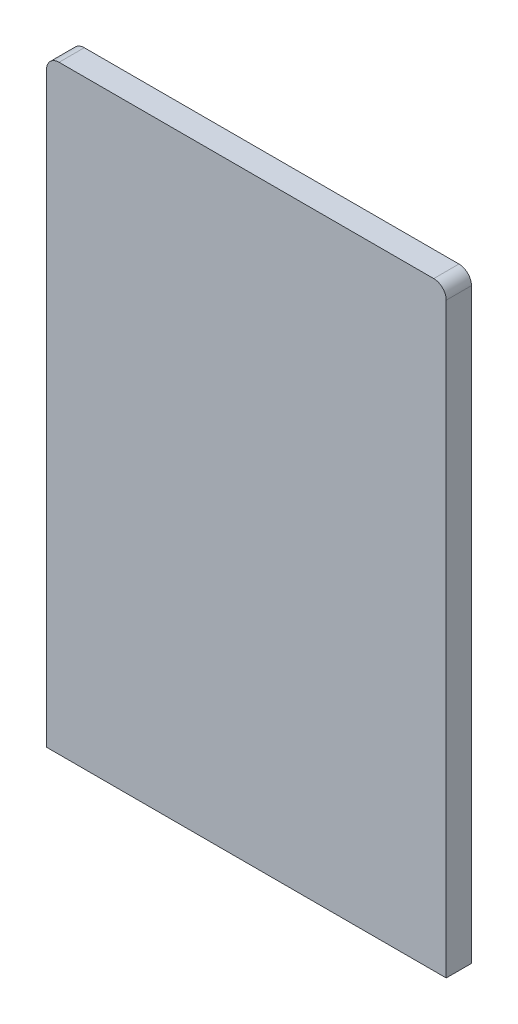
ISO-10303-21;
HEADER;
FILE_DESCRIPTION(('STEP AP214'),'2;1');
FILE_NAME('part.step','',(''),(''),'','','');
FILE_SCHEMA(('AUTOMOTIVE_DESIGN { 1 0 10303 214 1 1 1 1 }'));
ENDSEC;
DATA;
#1=APPLICATION_CONTEXT('core data for automotive mechanical design processes');
#2=APPLICATION_PROTOCOL_DEFINITION('international standard','automotive_design',2000,#1);
#3=PRODUCT_CONTEXT('',#1,'mechanical');
#4=PRODUCT('Part','Part','',(#3));
#5=PRODUCT_RELATED_PRODUCT_CATEGORY('part','',(#4));
#6=PRODUCT_DEFINITION_FORMATION('','',#4);
#7=PRODUCT_DEFINITION_CONTEXT('part definition',#1,'design');
#8=PRODUCT_DEFINITION('design','',#6,#7);
#9=PRODUCT_DEFINITION_SHAPE('','',#8);
#10=(LENGTH_UNIT() NAMED_UNIT(*) SI_UNIT(.MILLI.,.METRE.));
#11=(NAMED_UNIT(*) PLANE_ANGLE_UNIT() SI_UNIT($,.RADIAN.));
#12=(NAMED_UNIT(*) SI_UNIT($,.STERADIAN.) SOLID_ANGLE_UNIT());
#13=UNCERTAINTY_MEASURE_WITH_UNIT(LENGTH_MEASURE(1.E-05),#10,'distance_accuracy_value','');
#14=(GEOMETRIC_REPRESENTATION_CONTEXT(3) GLOBAL_UNCERTAINTY_ASSIGNED_CONTEXT((#13)) GLOBAL_UNIT_ASSIGNED_CONTEXT((#10,
#11,#12)) REPRESENTATION_CONTEXT('',''));
#15=CARTESIAN_POINT('',(0.,0.,0.));
#16=DIRECTION('',(0.,0.,1.));
#17=DIRECTION('',(1.,0.,0.));
#18=AXIS2_PLACEMENT_3D('',#15,#16,#17);
#19=CARTESIAN_POINT('',(4.,0.,0.105));
#20=DIRECTION('',(1.,0.,0.));
#21=DIRECTION('',(0.,1.,0.));
#22=AXIS2_PLACEMENT_3D('',#19,#20,#21);
#23=PLANE('',#22);
#24=DIRECTION('',(0.,0.,-1.));
#25=VECTOR('',#24,1.);
#26=CARTESIAN_POINT('',(4.,-8.,0.105));
#27=LINE('',#26,#25);
#28=CARTESIAN_POINT('',(4.,-8.,0.305));
#29=VERTEX_POINT('',#28);
#30=CARTESIAN_POINT('',(4.,-8.,-0.2));
#31=VERTEX_POINT('',#30);
#32=EDGE_CURVE('E189',#29,#31,#27,.T.);
#33=ORIENTED_EDGE('',*,*,#32,.T.);
#34=DIRECTION('',(0.,-1.,0.));
#35=VECTOR('',#34,1.);
#36=CARTESIAN_POINT('',(4.,0.,-0.2));
#37=LINE('',#36,#35);
#38=CARTESIAN_POINT('',(4.,3.75,-0.2));
#39=VERTEX_POINT('',#38);
#40=EDGE_CURVE('E176',#39,#31,#37,.T.);
#41=ORIENTED_EDGE('',*,*,#40,.F.);
#42=DIRECTION('',(0.,0.,-1.));
#43=VECTOR('',#42,1.);
#44=CARTESIAN_POINT('',(4.,3.75,0.105));
#45=LINE('',#44,#43);
#46=CARTESIAN_POINT('',(4.,3.75,0.305));
#47=VERTEX_POINT('',#46);
#48=EDGE_CURVE('E205',#39,#47,#45,.F.);
#49=ORIENTED_EDGE('',*,*,#48,.T.);
#50=DIRECTION('',(0.,1.,0.));
#51=VECTOR('',#50,1.);
#52=CARTESIAN_POINT('',(4.,0.,0.305));
#53=LINE('',#52,#51);
#54=EDGE_CURVE('E150',#29,#47,#53,.T.);
#55=ORIENTED_EDGE('',*,*,#54,.F.);
#56=EDGE_LOOP('',(#33,#41,#49,#55));
#57=FACE_BOUND('',#56,.T.);
#58=ADVANCED_FACE('F35',(#57),#23,.T.);
#59=CARTESIAN_POINT('',(0.,4.,0.105));
#60=DIRECTION('',(0.,1.,0.));
#61=DIRECTION('',(0.,0.,1.));
#62=AXIS2_PLACEMENT_3D('',#59,#60,#61);
#63=PLANE('',#62);
#64=DIRECTION('',(0.,0.,-1.));
#65=VECTOR('',#64,1.);
#66=CARTESIAN_POINT('',(3.75,4.,0.105));
#67=LINE('',#66,#65);
#68=CARTESIAN_POINT('',(3.75,4.,0.305));
#69=VERTEX_POINT('',#68);
#70=CARTESIAN_POINT('',(3.75,4.,-0.2));
#71=VERTEX_POINT('',#70);
#72=EDGE_CURVE('E125',#69,#71,#67,.T.);
#73=ORIENTED_EDGE('',*,*,#72,.T.);
#74=DIRECTION('',(1.,0.,0.));
#75=VECTOR('',#74,1.);
#76=CARTESIAN_POINT('',(0.,4.,-0.2));
#77=LINE('',#76,#75);
#78=CARTESIAN_POINT('',(-3.75,4.,-0.2));
#79=VERTEX_POINT('',#78);
#80=EDGE_CURVE('E173',#79,#71,#77,.T.);
#81=ORIENTED_EDGE('',*,*,#80,.F.);
#82=DIRECTION('',(0.,0.,-1.));
#83=VECTOR('',#82,1.);
#84=CARTESIAN_POINT('',(-3.75,4.,0.105));
#85=LINE('',#84,#83);
#86=CARTESIAN_POINT('',(-3.75,4.,0.305));
#87=VERTEX_POINT('',#86);
#88=EDGE_CURVE('E135',#79,#87,#85,.F.);
#89=ORIENTED_EDGE('',*,*,#88,.T.);
#90=DIRECTION('',(-1.,0.,0.));
#91=VECTOR('',#90,1.);
#92=CARTESIAN_POINT('',(0.,4.,0.305));
#93=LINE('',#92,#91);
#94=EDGE_CURVE('E139',#69,#87,#93,.T.);
#95=ORIENTED_EDGE('',*,*,#94,.F.);
#96=EDGE_LOOP('',(#73,#81,#89,#95));
#97=FACE_BOUND('',#96,.T.);
#98=ADVANCED_FACE('F140',(#97),#63,.T.);
#99=CARTESIAN_POINT('',(-4.,0.,0.105));
#100=DIRECTION('',(-1.,0.,0.));
#101=DIRECTION('',(0.,0.,1.));
#102=AXIS2_PLACEMENT_3D('',#99,#100,#101);
#103=PLANE('',#102);
#104=DIRECTION('',(0.,0.,-1.));
#105=VECTOR('',#104,1.);
#106=CARTESIAN_POINT('',(-4.,-8.,0.105));
#107=LINE('',#106,#105);
#108=CARTESIAN_POINT('',(-4.,-8.,0.305));
#109=VERTEX_POINT('',#108);
#110=CARTESIAN_POINT('',(-4.,-8.,-0.2));
#111=VERTEX_POINT('',#110);
#112=EDGE_CURVE('E201',#109,#111,#107,.T.);
#113=ORIENTED_EDGE('',*,*,#112,.F.);
#114=DIRECTION('',(0.,-1.,0.));
#115=VECTOR('',#114,1.);
#116=CARTESIAN_POINT('',(-4.,0.,0.305));
#117=LINE('',#116,#115);
#118=CARTESIAN_POINT('',(-4.,3.75,0.305));
#119=VERTEX_POINT('',#118);
#120=EDGE_CURVE('E157',#119,#109,#117,.T.);
#121=ORIENTED_EDGE('',*,*,#120,.F.);
#122=DIRECTION('',(0.,0.,-1.));
#123=VECTOR('',#122,1.);
#124=CARTESIAN_POINT('',(-4.,3.75,0.105));
#125=LINE('',#124,#123);
#126=CARTESIAN_POINT('',(-4.,3.75,-0.2));
#127=VERTEX_POINT('',#126);
#128=EDGE_CURVE('E136',#119,#127,#125,.T.);
#129=ORIENTED_EDGE('',*,*,#128,.T.);
#130=DIRECTION('',(0.,1.,0.));
#131=VECTOR('',#130,1.);
#132=CARTESIAN_POINT('',(-4.,0.,-0.2));
#133=LINE('',#132,#131);
#134=EDGE_CURVE('E167',#111,#127,#133,.T.);
#135=ORIENTED_EDGE('',*,*,#134,.F.);
#136=EDGE_LOOP('',(#113,#121,#129,#135));
#137=FACE_BOUND('',#136,.T.);
#138=ADVANCED_FACE('F251',(#137),#103,.T.);
#139=CARTESIAN_POINT('',(-2.75,0.,0.105));
#140=DIRECTION('',(1.,0.,0.));
#141=DIRECTION('',(0.,1.,0.));
#142=AXIS2_PLACEMENT_3D('',#139,#140,#141);
#143=PLANE('',#142);
#144=DIRECTION('',(0.,-1.,0.));
#145=VECTOR('',#144,1.);
#146=CARTESIAN_POINT('',(-2.75,0.,0.));
#147=LINE('',#146,#145);
#148=CARTESIAN_POINT('',(-2.75,2.5,0.));
#149=VERTEX_POINT('',#148);
#150=CARTESIAN_POINT('',(-2.75,-8.,0.));
#151=VERTEX_POINT('',#150);
#152=EDGE_CURVE('E179',#149,#151,#147,.T.);
#153=ORIENTED_EDGE('',*,*,#152,.F.);
#154=DIRECTION('',(0.,0.,-1.));
#155=VECTOR('',#154,1.);
#156=CARTESIAN_POINT('',(-2.75,2.5,0.105));
#157=LINE('',#156,#155);
#158=CARTESIAN_POINT('',(-2.75,2.5,0.105));
#159=VERTEX_POINT('',#158);
#160=EDGE_CURVE('E211',#149,#159,#157,.F.);
#161=ORIENTED_EDGE('',*,*,#160,.T.);
#162=DIRECTION('',(0.,-1.,0.));
#163=VECTOR('',#162,1.);
#164=CARTESIAN_POINT('',(-2.75,0.,0.105));
#165=LINE('',#164,#163);
#166=CARTESIAN_POINT('',(-2.75,-8.,0.105));
#167=VERTEX_POINT('',#166);
#168=EDGE_CURVE('E182',#159,#167,#165,.T.);
#169=ORIENTED_EDGE('',*,*,#168,.T.);
#170=DIRECTION('',(0.,0.,-1.));
#171=VECTOR('',#170,1.);
#172=CARTESIAN_POINT('',(-2.75,-8.,0.105));
#173=LINE('',#172,#171);
#174=EDGE_CURVE('E199',#167,#151,#173,.T.);
#175=ORIENTED_EDGE('',*,*,#174,.T.);
#176=EDGE_LOOP('',(#153,#161,#169,#175));
#177=FACE_BOUND('',#176,.T.);
#178=ADVANCED_FACE('F235',(#177),#143,.T.);
#179=CARTESIAN_POINT('',(0.,2.75,0.105));
#180=DIRECTION('',(0.,1.,0.));
#181=DIRECTION('',(0.,0.,1.));
#182=AXIS2_PLACEMENT_3D('',#179,#180,#181);
#183=PLANE('',#182);
#184=DIRECTION('',(1.,0.,0.));
#185=VECTOR('',#184,1.);
#186=CARTESIAN_POINT('',(0.,2.75,0.105));
#187=LINE('',#186,#185);
#188=CARTESIAN_POINT('',(-2.5,2.75,0.105));
#189=VERTEX_POINT('',#188);
#190=CARTESIAN_POINT('',(2.5,2.75,0.105));
#191=VERTEX_POINT('',#190);
#192=EDGE_CURVE('E184',#189,#191,#187,.T.);
#193=ORIENTED_EDGE('',*,*,#192,.F.);
#194=DIRECTION('',(0.,0.,-1.));
#195=VECTOR('',#194,1.);
#196=CARTESIAN_POINT('',(-2.5,2.75,0.105));
#197=LINE('',#196,#195);
#198=CARTESIAN_POINT('',(-2.5,2.75,0.));
#199=VERTEX_POINT('',#198);
#200=EDGE_CURVE('E208',#189,#199,#197,.T.);
#201=ORIENTED_EDGE('',*,*,#200,.T.);
#202=DIRECTION('',(1.,0.,0.));
#203=VECTOR('',#202,1.);
#204=CARTESIAN_POINT('',(0.,2.75,0.));
#205=LINE('',#204,#203);
#206=CARTESIAN_POINT('',(2.5,2.75,0.));
#207=VERTEX_POINT('',#206);
#208=EDGE_CURVE('E192',#199,#207,#205,.T.);
#209=ORIENTED_EDGE('',*,*,#208,.T.);
#210=DIRECTION('',(0.,0.,-1.));
#211=VECTOR('',#210,1.);
#212=CARTESIAN_POINT('',(2.5,2.75,0.105));
#213=LINE('',#212,#211);
#214=EDGE_CURVE('E58',#207,#191,#213,.F.);
#215=ORIENTED_EDGE('',*,*,#214,.T.);
#216=EDGE_LOOP('',(#193,#201,#209,#215));
#217=FACE_BOUND('',#216,.T.);
#218=ADVANCED_FACE('F243',(#217),#183,.F.);
#219=CARTESIAN_POINT('',(2.75,0.,0.105));
#220=DIRECTION('',(1.,0.,0.));
#221=DIRECTION('',(0.,1.,0.));
#222=AXIS2_PLACEMENT_3D('',#219,#220,#221);
#223=PLANE('',#222);
#224=DIRECTION('',(0.,-1.,0.));
#225=VECTOR('',#224,1.);
#226=CARTESIAN_POINT('',(2.75,0.,0.105));
#227=LINE('',#226,#225);
#228=CARTESIAN_POINT('',(2.75,2.5,0.105));
#229=VERTEX_POINT('',#228);
#230=CARTESIAN_POINT('',(2.75,-8.,0.105));
#231=VERTEX_POINT('',#230);
#232=EDGE_CURVE('E50',#229,#231,#227,.T.);
#233=ORIENTED_EDGE('',*,*,#232,.F.);
#234=DIRECTION('',(0.,0.,-1.));
#235=VECTOR('',#234,1.);
#236=CARTESIAN_POINT('',(2.75,2.5,0.));
#237=LINE('',#236,#235);
#238=CARTESIAN_POINT('',(2.75,2.5,0.));
#239=VERTEX_POINT('',#238);
#240=EDGE_CURVE('E213',#229,#239,#237,.T.);
#241=ORIENTED_EDGE('',*,*,#240,.T.);
#242=DIRECTION('',(0.,-1.,0.));
#243=VECTOR('',#242,1.);
#244=CARTESIAN_POINT('',(2.75,0.,0.));
#245=LINE('',#244,#243);
#246=CARTESIAN_POINT('',(2.75,-8.,0.));
#247=VERTEX_POINT('',#246);
#248=EDGE_CURVE('E185',#239,#247,#245,.T.);
#249=ORIENTED_EDGE('',*,*,#248,.T.);
#250=DIRECTION('',(0.,0.,-1.));
#251=VECTOR('',#250,1.);
#252=CARTESIAN_POINT('',(2.75,-8.,0.105));
#253=LINE('',#252,#251);
#254=EDGE_CURVE('E196',#231,#247,#253,.T.);
#255=ORIENTED_EDGE('',*,*,#254,.F.);
#256=EDGE_LOOP('',(#233,#241,#249,#255));
#257=FACE_BOUND('',#256,.T.);
#258=ADVANCED_FACE('F227',(#257),#223,.F.);
#259=CARTESIAN_POINT('',(0.,-8.,0.105));
#260=DIRECTION('',(0.,1.,0.));
#261=DIRECTION('',(0.,0.,1.));
#262=AXIS2_PLACEMENT_3D('',#259,#260,#261);
#263=PLANE('',#262);
#264=ORIENTED_EDGE('',*,*,#174,.F.);
#265=DIRECTION('',(1.,0.,0.));
#266=VECTOR('',#265,1.);
#267=CARTESIAN_POINT('',(0.,-8.,0.105));
#268=LINE('',#267,#266);
#269=EDGE_CURVE('E151',#167,#231,#268,.T.);
#270=ORIENTED_EDGE('',*,*,#269,.T.);
#271=ORIENTED_EDGE('',*,*,#254,.T.);
#272=DIRECTION('',(-1.,0.,0.));
#273=VECTOR('',#272,1.);
#274=CARTESIAN_POINT('',(0.,-8.,0.));
#275=LINE('',#274,#273);
#276=EDGE_CURVE('E162',#247,#151,#275,.T.);
#277=ORIENTED_EDGE('',*,*,#276,.T.);
#278=EDGE_LOOP('',(#264,#270,#271,#277));
#279=FACE_BOUND('',#278,.T.);
#280=DIRECTION('',(1.,0.,0.));
#281=VECTOR('',#280,1.);
#282=CARTESIAN_POINT('',(0.,-8.,0.305));
#283=LINE('',#282,#281);
#284=EDGE_CURVE('E160',#109,#29,#283,.T.);
#285=ORIENTED_EDGE('',*,*,#284,.F.);
#286=ORIENTED_EDGE('',*,*,#112,.T.);
#287=DIRECTION('',(-1.,0.,0.));
#288=VECTOR('',#287,1.);
#289=CARTESIAN_POINT('',(0.,-8.,-0.2));
#290=LINE('',#289,#288);
#291=EDGE_CURVE('E164',#31,#111,#290,.T.);
#292=ORIENTED_EDGE('',*,*,#291,.F.);
#293=ORIENTED_EDGE('',*,*,#32,.F.);
#294=EDGE_LOOP('',(#285,#286,#292,#293));
#295=FACE_BOUND('',#294,.T.);
#296=ADVANCED_FACE('F230',(#279,#295),#263,.F.);
#297=CARTESIAN_POINT('',(-3.75,3.75,0.105));
#298=DIRECTION('',(0.,0.,-1.));
#299=DIRECTION('',(-1.,0.,0.));
#300=AXIS2_PLACEMENT_3D('',#297,#298,#299);
#301=CYLINDRICAL_SURFACE('',#300,0.25);
#302=ORIENTED_EDGE('',*,*,#128,.F.);
#303=CARTESIAN_POINT('',(-3.75,3.75,0.305));
#304=DIRECTION('',(0.,0.,1.));
#305=DIRECTION('',(1.,0.,0.));
#306=AXIS2_PLACEMENT_3D('',#303,#304,#305);
#307=CIRCLE('',#306,0.25);
#308=EDGE_CURVE('E144',#87,#119,#307,.T.);
#309=ORIENTED_EDGE('',*,*,#308,.F.);
#310=ORIENTED_EDGE('',*,*,#88,.F.);
#311=CARTESIAN_POINT('',(-3.75,3.75,-0.2));
#312=DIRECTION('',(0.,0.,-1.));
#313=DIRECTION('',(-1.,0.,0.));
#314=AXIS2_PLACEMENT_3D('',#311,#312,#313);
#315=CIRCLE('',#314,0.25);
#316=EDGE_CURVE('E170',#127,#79,#315,.T.);
#317=ORIENTED_EDGE('',*,*,#316,.F.);
#318=EDGE_LOOP('',(#302,#309,#310,#317));
#319=FACE_BOUND('',#318,.T.);
#320=ADVANCED_FACE('F263',(#319),#301,.T.);
#321=CARTESIAN_POINT('',(3.75,3.75,0.105));
#322=DIRECTION('',(0.,0.,-1.));
#323=DIRECTION('',(-1.,0.,0.));
#324=AXIS2_PLACEMENT_3D('',#321,#322,#323);
#325=CYLINDRICAL_SURFACE('',#324,0.25);
#326=ORIENTED_EDGE('',*,*,#72,.F.);
#327=CARTESIAN_POINT('',(3.75,3.75,0.305));
#328=DIRECTION('',(0.,0.,1.));
#329=DIRECTION('',(1.,0.,0.));
#330=AXIS2_PLACEMENT_3D('',#327,#328,#329);
#331=CIRCLE('',#330,0.25);
#332=EDGE_CURVE('E129',#47,#69,#331,.T.);
#333=ORIENTED_EDGE('',*,*,#332,.F.);
#334=ORIENTED_EDGE('',*,*,#48,.F.);
#335=CARTESIAN_POINT('',(3.75,3.75,-0.2));
#336=DIRECTION('',(0.,0.,-1.));
#337=DIRECTION('',(-1.,0.,0.));
#338=AXIS2_PLACEMENT_3D('',#335,#336,#337);
#339=CIRCLE('',#338,0.25);
#340=EDGE_CURVE('E131',#71,#39,#339,.T.);
#341=ORIENTED_EDGE('',*,*,#340,.F.);
#342=EDGE_LOOP('',(#326,#333,#334,#341));
#343=FACE_BOUND('',#342,.T.);
#344=ADVANCED_FACE('F127',(#343),#325,.T.);
#345=CARTESIAN_POINT('',(-2.5,2.5,0.105));
#346=DIRECTION('',(0.,0.,-1.));
#347=DIRECTION('',(-1.,0.,0.));
#348=AXIS2_PLACEMENT_3D('',#345,#346,#347);
#349=CYLINDRICAL_SURFACE('',#348,0.25);
#350=CARTESIAN_POINT('',(-2.5,2.5,0.105));
#351=DIRECTION('',(0.,0.,1.));
#352=DIRECTION('',(1.,0.,0.));
#353=AXIS2_PLACEMENT_3D('',#350,#351,#352);
#354=CIRCLE('',#353,0.25);
#355=EDGE_CURVE('E218',#159,#189,#354,.F.);
#356=ORIENTED_EDGE('',*,*,#355,.F.);
#357=ORIENTED_EDGE('',*,*,#160,.F.);
#358=CARTESIAN_POINT('',(-2.5,2.5,0.));
#359=DIRECTION('',(0.,0.,1.));
#360=DIRECTION('',(1.,0.,0.));
#361=AXIS2_PLACEMENT_3D('',#358,#359,#360);
#362=CIRCLE('',#361,0.25);
#363=EDGE_CURVE('E215',#199,#149,#362,.T.);
#364=ORIENTED_EDGE('',*,*,#363,.F.);
#365=ORIENTED_EDGE('',*,*,#200,.F.);
#366=EDGE_LOOP('',(#356,#357,#364,#365));
#367=FACE_BOUND('',#366,.T.);
#368=ADVANCED_FACE('F238',(#367),#349,.F.);
#369=CARTESIAN_POINT('',(2.5,2.5,0.105));
#370=DIRECTION('',(0.,0.,1.));
#371=DIRECTION('',(1.,0.,0.));
#372=AXIS2_PLACEMENT_3D('',#369,#370,#371);
#373=CYLINDRICAL_SURFACE('',#372,0.25);
#374=CARTESIAN_POINT('',(2.5,2.5,0.105));
#375=DIRECTION('',(0.,0.,1.));
#376=DIRECTION('',(1.,0.,0.));
#377=AXIS2_PLACEMENT_3D('',#374,#375,#376);
#378=CIRCLE('',#377,0.25);
#379=EDGE_CURVE('E11',#191,#229,#378,.F.);
#380=ORIENTED_EDGE('',*,*,#379,.F.);
#381=ORIENTED_EDGE('',*,*,#214,.F.);
#382=CARTESIAN_POINT('',(2.5,2.5,0.));
#383=DIRECTION('',(0.,0.,1.));
#384=DIRECTION('',(1.,0.,0.));
#385=AXIS2_PLACEMENT_3D('',#382,#383,#384);
#386=CIRCLE('',#385,0.25);
#387=EDGE_CURVE('E43',#239,#207,#386,.T.);
#388=ORIENTED_EDGE('',*,*,#387,.F.);
#389=ORIENTED_EDGE('',*,*,#240,.F.);
#390=EDGE_LOOP('',(#380,#381,#388,#389));
#391=FACE_BOUND('',#390,.T.);
#392=ADVANCED_FACE('F37',(#391),#373,.F.);
#393=CARTESIAN_POINT('',(0.,0.,-0.2));
#394=DIRECTION('',(0.,0.,-1.));
#395=DIRECTION('',(-1.,0.,0.));
#396=AXIS2_PLACEMENT_3D('',#393,#394,#395);
#397=PLANE('',#396);
#398=ORIENTED_EDGE('',*,*,#291,.T.);
#399=ORIENTED_EDGE('',*,*,#134,.T.);
#400=ORIENTED_EDGE('',*,*,#316,.T.);
#401=ORIENTED_EDGE('',*,*,#80,.T.);
#402=ORIENTED_EDGE('',*,*,#340,.T.);
#403=ORIENTED_EDGE('',*,*,#40,.T.);
#404=EDGE_LOOP('',(#398,#399,#400,#401,#402,#403));
#405=FACE_BOUND('',#404,.T.);
#406=ADVANCED_FACE('F273',(#405),#397,.T.);
#407=CARTESIAN_POINT('',(0.,0.,0.));
#408=DIRECTION('',(0.,0.,-1.));
#409=DIRECTION('',(-1.,0.,0.));
#410=AXIS2_PLACEMENT_3D('',#407,#408,#409);
#411=PLANE('',#410);
#412=ORIENTED_EDGE('',*,*,#248,.F.);
#413=ORIENTED_EDGE('',*,*,#387,.T.);
#414=ORIENTED_EDGE('',*,*,#208,.F.);
#415=ORIENTED_EDGE('',*,*,#363,.T.);
#416=ORIENTED_EDGE('',*,*,#152,.T.);
#417=ORIENTED_EDGE('',*,*,#276,.F.);
#418=EDGE_LOOP('',(#412,#413,#414,#415,#416,#417));
#419=FACE_BOUND('',#418,.T.);
#420=ADVANCED_FACE('F224',(#419),#411,.F.);
#421=CARTESIAN_POINT('',(0.,0.,0.305));
#422=DIRECTION('',(0.,0.,1.));
#423=DIRECTION('',(1.,0.,0.));
#424=AXIS2_PLACEMENT_3D('',#421,#422,#423);
#425=PLANE('',#424);
#426=ORIENTED_EDGE('',*,*,#332,.T.);
#427=ORIENTED_EDGE('',*,*,#94,.T.);
#428=ORIENTED_EDGE('',*,*,#308,.T.);
#429=ORIENTED_EDGE('',*,*,#120,.T.);
#430=ORIENTED_EDGE('',*,*,#284,.T.);
#431=ORIENTED_EDGE('',*,*,#54,.T.);
#432=EDGE_LOOP('',(#426,#427,#428,#429,#430,#431));
#433=FACE_BOUND('',#432,.T.);
#434=ADVANCED_FACE('F147',(#433),#425,.T.);
#435=CARTESIAN_POINT('',(0.,0.,0.105));
#436=DIRECTION('',(0.,0.,1.));
#437=DIRECTION('',(1.,0.,0.));
#438=AXIS2_PLACEMENT_3D('',#435,#436,#437);
#439=PLANE('',#438);
#440=ORIENTED_EDGE('',*,*,#168,.F.);
#441=ORIENTED_EDGE('',*,*,#355,.T.);
#442=ORIENTED_EDGE('',*,*,#192,.T.);
#443=ORIENTED_EDGE('',*,*,#379,.T.);
#444=ORIENTED_EDGE('',*,*,#232,.T.);
#445=ORIENTED_EDGE('',*,*,#269,.F.);
#446=EDGE_LOOP('',(#440,#441,#442,#443,#444,#445));
#447=FACE_BOUND('',#446,.T.);
#448=ADVANCED_FACE('F242',(#447),#439,.F.);
#449=CLOSED_SHELL('',(#58,#98,#138,#178,#218,#258,#296,#320,#344,#368,#392,#406,#420,#434,#448));
#450=MANIFOLD_SOLID_BREP('B2',#449);
#451=ADVANCED_BREP_SHAPE_REPRESENTATION('',(#18,#450),#14);
#452=SHAPE_DEFINITION_REPRESENTATION(#9,#451);
ENDSEC;
END-ISO-10303-21;
